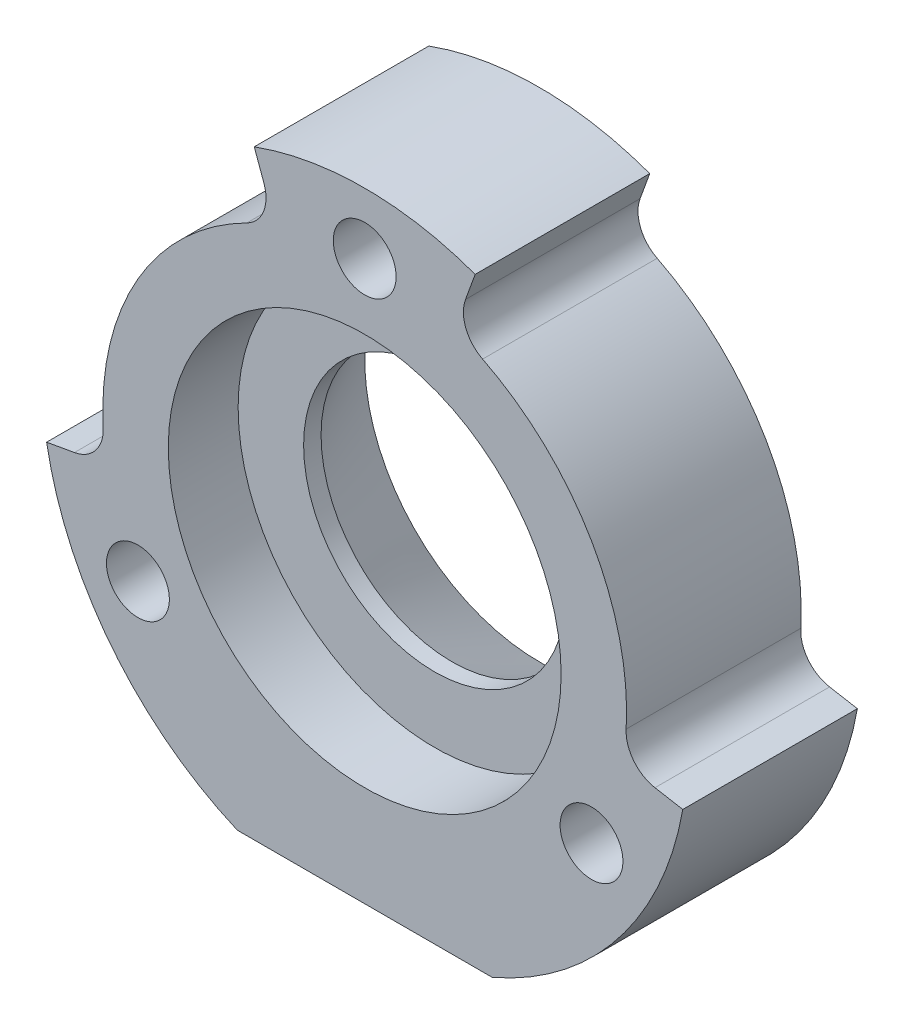
ISO-10303-21;
HEADER;
FILE_DESCRIPTION(('STEP AP214'),'2;1');
FILE_NAME('part.step','',(''),(''),'','','');
FILE_SCHEMA(('AUTOMOTIVE_DESIGN { 1 0 10303 214 1 1 1 1 }'));
ENDSEC;
DATA;
#1=APPLICATION_CONTEXT('core data for automotive mechanical design processes');
#2=APPLICATION_PROTOCOL_DEFINITION('international standard','automotive_design',2000,#1);
#3=PRODUCT_CONTEXT('',#1,'mechanical');
#4=PRODUCT('Part','Part','',(#3));
#5=PRODUCT_RELATED_PRODUCT_CATEGORY('part','',(#4));
#6=PRODUCT_DEFINITION_FORMATION('','',#4);
#7=PRODUCT_DEFINITION_CONTEXT('part definition',#1,'design');
#8=PRODUCT_DEFINITION('design','',#6,#7);
#9=PRODUCT_DEFINITION_SHAPE('','',#8);
#10=(LENGTH_UNIT() NAMED_UNIT(*) SI_UNIT(.MILLI.,.METRE.));
#11=(NAMED_UNIT(*) PLANE_ANGLE_UNIT() SI_UNIT($,.RADIAN.));
#12=(NAMED_UNIT(*) SI_UNIT($,.STERADIAN.) SOLID_ANGLE_UNIT());
#13=UNCERTAINTY_MEASURE_WITH_UNIT(LENGTH_MEASURE(1.E-05),#10,'distance_accuracy_value','');
#14=(GEOMETRIC_REPRESENTATION_CONTEXT(3) GLOBAL_UNCERTAINTY_ASSIGNED_CONTEXT((#13)) GLOBAL_UNIT_ASSIGNED_CONTEXT((#10,
#11,#12)) REPRESENTATION_CONTEXT('',''));
#15=CARTESIAN_POINT('',(0.,0.,0.));
#16=DIRECTION('',(0.,0.,1.));
#17=DIRECTION('',(1.,0.,0.));
#18=AXIS2_PLACEMENT_3D('',#15,#16,#17);
#19=CARTESIAN_POINT('',(-450.,150.,0.));
#20=DIRECTION('',(0.,0.,1.));
#21=DIRECTION('',(1.,0.,0.));
#22=AXIS2_PLACEMENT_3D('',#19,#20,#21);
#23=CYLINDRICAL_SURFACE('',#22,18.4999999999999);
#24=DIRECTION('',(0.,0.,-1.));
#25=VECTOR('',#24,1.);
#26=CARTESIAN_POINT('',(-468.218943430726,146.787508713162,10.));
#27=LINE('',#26,#25);
#28=CARTESIAN_POINT('',(-468.218943430726,146.787508713162,10.));
#29=VERTEX_POINT('',#28);
#30=CARTESIAN_POINT('',(-468.218943430726,146.787508713162,0.));
#31=VERTEX_POINT('',#30);
#32=EDGE_CURVE('E148',#29,#31,#27,.T.);
#33=ORIENTED_EDGE('',*,*,#32,.T.);
#34=CARTESIAN_POINT('',(-450.,150.,0.));
#35=DIRECTION('',(0.,0.,1.));
#36=DIRECTION('',(1.,0.,0.));
#37=AXIS2_PLACEMENT_3D('',#34,#35,#36);
#38=CIRCLE('',#37,18.4999999999999);
#39=CARTESIAN_POINT('',(-457.297259759663,133.,0.));
#40=VERTEX_POINT('',#39);
#41=EDGE_CURVE('E168',#31,#40,#38,.T.);
#42=ORIENTED_EDGE('',*,*,#41,.T.);
#43=DIRECTION('',(0.,0.,1.));
#44=VECTOR('',#43,1.);
#45=CARTESIAN_POINT('',(-457.297259759663,133.,0.));
#46=LINE('',#45,#44);
#47=CARTESIAN_POINT('',(-457.297259759663,133.,10.));
#48=VERTEX_POINT('',#47);
#49=EDGE_CURVE('E172',#40,#48,#46,.T.);
#50=ORIENTED_EDGE('',*,*,#49,.T.);
#51=CARTESIAN_POINT('',(-450.,150.,10.));
#52=DIRECTION('',(0.,0.,1.));
#53=DIRECTION('',(1.,0.,0.));
#54=AXIS2_PLACEMENT_3D('',#51,#52,#53);
#55=CIRCLE('',#54,18.4999999999999);
#56=EDGE_CURVE('E157',#29,#48,#55,.T.);
#57=ORIENTED_EDGE('',*,*,#56,.F.);
#58=EDGE_LOOP('',(#33,#42,#50,#57));
#59=FACE_BOUND('',#58,.T.);
#60=ADVANCED_FACE('F33',(#59),#23,.T.);
#61=DIRECTION('',(0.,0.,-1.));
#62=VECTOR('',#61,1.);
#63=CARTESIAN_POINT('',(-456.327372651525,167.384313484539,10.));
#64=LINE('',#63,#62);
#65=CARTESIAN_POINT('',(-456.327372651525,167.384313484539,10.));
#66=VERTEX_POINT('',#65);
#67=CARTESIAN_POINT('',(-456.327372651525,167.384313484539,0.));
#68=VERTEX_POINT('',#67);
#69=EDGE_CURVE('E133',#66,#68,#64,.T.);
#70=ORIENTED_EDGE('',*,*,#69,.F.);
#71=CARTESIAN_POINT('',(-443.672627348475,167.384313484539,10.));
#72=VERTEX_POINT('',#71);
#73=EDGE_CURVE('E145',#72,#66,#55,.T.);
#74=ORIENTED_EDGE('',*,*,#73,.F.);
#75=DIRECTION('',(0.,0.,-1.));
#76=VECTOR('',#75,1.);
#77=CARTESIAN_POINT('',(-443.672627348475,167.384313484539,10.));
#78=LINE('',#77,#76);
#79=CARTESIAN_POINT('',(-443.672627348475,167.384313484539,0.));
#80=VERTEX_POINT('',#79);
#81=EDGE_CURVE('E161',#72,#80,#78,.T.);
#82=ORIENTED_EDGE('',*,*,#81,.T.);
#83=EDGE_CURVE('E147',#80,#68,#38,.T.);
#84=ORIENTED_EDGE('',*,*,#83,.T.);
#85=EDGE_LOOP('',(#70,#74,#82,#84));
#86=FACE_BOUND('',#85,.T.);
#87=ADVANCED_FACE('F143',(#86),#23,.T.);
#88=DIRECTION('',(0.,0.,-1.));
#89=VECTOR('',#88,1.);
#90=CARTESIAN_POINT('',(-431.781056569274,146.787508713162,10.));
#91=LINE('',#90,#89);
#92=CARTESIAN_POINT('',(-431.781056569274,146.787508713162,10.));
#93=VERTEX_POINT('',#92);
#94=CARTESIAN_POINT('',(-431.781056569274,146.787508713162,0.));
#95=VERTEX_POINT('',#94);
#96=EDGE_CURVE('E241',#93,#95,#91,.T.);
#97=ORIENTED_EDGE('',*,*,#96,.F.);
#98=CARTESIAN_POINT('',(-442.702740240337,133.,10.));
#99=VERTEX_POINT('',#98);
#100=EDGE_CURVE('E156',#99,#93,#55,.T.);
#101=ORIENTED_EDGE('',*,*,#100,.F.);
#102=DIRECTION('',(0.,0.,1.));
#103=VECTOR('',#102,1.);
#104=CARTESIAN_POINT('',(-442.702740240337,133.,0.));
#105=LINE('',#104,#103);
#106=CARTESIAN_POINT('',(-442.702740240337,133.,0.));
#107=VERTEX_POINT('',#106);
#108=EDGE_CURVE('E169',#107,#99,#105,.T.);
#109=ORIENTED_EDGE('',*,*,#108,.F.);
#110=EDGE_CURVE('E249',#107,#95,#38,.T.);
#111=ORIENTED_EDGE('',*,*,#110,.T.);
#112=EDGE_LOOP('',(#97,#101,#109,#111));
#113=FACE_BOUND('',#112,.T.);
#114=ADVANCED_FACE('F365',(#113),#23,.T.);
#115=CARTESIAN_POINT('',(-457.297259759663,133.,0.));
#116=DIRECTION('',(0.,-1.,0.));
#117=DIRECTION('',(0.,0.,-1.));
#118=AXIS2_PLACEMENT_3D('',#115,#116,#117);
#119=PLANE('',#118);
#120=DIRECTION('',(1.,0.,0.));
#121=VECTOR('',#120,1.);
#122=CARTESIAN_POINT('',(-457.297259759663,133.,10.));
#123=LINE('',#122,#121);
#124=EDGE_CURVE('E160',#48,#99,#123,.T.);
#125=ORIENTED_EDGE('',*,*,#124,.F.);
#126=ORIENTED_EDGE('',*,*,#49,.F.);
#127=DIRECTION('',(1.,0.,0.));
#128=VECTOR('',#127,1.);
#129=CARTESIAN_POINT('',(-457.297259759663,133.,0.));
#130=LINE('',#129,#128);
#131=EDGE_CURVE('E164',#40,#107,#130,.T.);
#132=ORIENTED_EDGE('',*,*,#131,.T.);
#133=ORIENTED_EDGE('',*,*,#108,.T.);
#134=EDGE_LOOP('',(#125,#126,#132,#133));
#135=FACE_BOUND('',#134,.T.);
#136=ADVANCED_FACE('F260',(#135),#119,.T.);
#137=CARTESIAN_POINT('',(-450.,150.,0.));
#138=DIRECTION('',(0.,0.,1.));
#139=DIRECTION('',(1.,0.,0.));
#140=AXIS2_PLACEMENT_3D('',#137,#138,#139);
#141=PLANE('',#140);
#142=CARTESIAN_POINT('',(-450.,150.,0.));
#143=DIRECTION('',(0.,0.,1.));
#144=DIRECTION('',(1.,0.,0.));
#145=AXIS2_PLACEMENT_3D('',#142,#143,#144);
#146=CIRCLE('',#145,10.);
#147=CARTESIAN_POINT('',(-440.,150.,0.));
#148=VERTEX_POINT('',#147);
#149=EDGE_CURVE('E313',#148,#148,#146,.T.);
#150=ORIENTED_EDGE('',*,*,#149,.T.);
#151=EDGE_LOOP('',(#150));
#152=FACE_BOUND('',#151,.T.);
#153=CARTESIAN_POINT('',(-437.009618943233,142.5,0.));
#154=DIRECTION('',(0.,0.,-1.));
#155=DIRECTION('',(-1.,0.,0.));
#156=AXIS2_PLACEMENT_3D('',#153,#154,#155);
#157=CIRCLE('',#156,1.80000000000002);
#158=CARTESIAN_POINT('',(-438.809618943233,142.5,0.));
#159=VERTEX_POINT('',#158);
#160=EDGE_CURVE('E298',#159,#159,#157,.T.);
#161=ORIENTED_EDGE('',*,*,#160,.F.);
#162=EDGE_LOOP('',(#161));
#163=FACE_BOUND('',#162,.T.);
#164=CARTESIAN_POINT('',(-450.,165.,0.));
#165=DIRECTION('',(0.,0.,-1.));
#166=DIRECTION('',(-1.,0.,0.));
#167=AXIS2_PLACEMENT_3D('',#164,#165,#166);
#168=CIRCLE('',#167,1.80000000000002);
#169=CARTESIAN_POINT('',(-451.8,165.,0.));
#170=VERTEX_POINT('',#169);
#171=EDGE_CURVE('E292',#170,#170,#168,.T.);
#172=ORIENTED_EDGE('',*,*,#171,.F.);
#173=EDGE_LOOP('',(#172));
#174=FACE_BOUND('',#173,.T.);
#175=CARTESIAN_POINT('',(-462.990381056767,142.5,0.));
#176=DIRECTION('',(0.,0.,-1.));
#177=DIRECTION('',(-1.,0.,0.));
#178=AXIS2_PLACEMENT_3D('',#175,#176,#177);
#179=CIRCLE('',#178,1.80000000000002);
#180=CARTESIAN_POINT('',(-464.790381056767,142.5,0.));
#181=VERTEX_POINT('',#180);
#182=EDGE_CURVE('E286',#181,#181,#179,.T.);
#183=ORIENTED_EDGE('',*,*,#182,.F.);
#184=EDGE_LOOP('',(#183));
#185=FACE_BOUND('',#184,.T.);
#186=ORIENTED_EDGE('',*,*,#41,.F.);
#187=DIRECTION('',(-0.984807753012215,-0.173648177666892,0.));
#188=VECTOR('',#187,1.);
#189=CARTESIAN_POINT('',(-464.772116295183,147.395277334996,0.));
#190=LINE('',#189,#188);
#191=CARTESIAN_POINT('',(-466.625468368199,147.068481359772,0.));
#192=VERTEX_POINT('',#191);
#193=EDGE_CURVE('E138',#192,#31,#190,.T.);
#194=ORIENTED_EDGE('',*,*,#193,.F.);
#195=CARTESIAN_POINT('',(-466.972764723533,149.038096865796,0.));
#196=DIRECTION('',(0.,0.,1.));
#197=DIRECTION('',(1.,0.,0.));
#198=AXIS2_PLACEMENT_3D('',#195,#196,#197);
#199=CIRCLE('',#198,2.);
#200=CARTESIAN_POINT('',(-464.975968873706,149.151261940408,0.));
#201=VERTEX_POINT('',#200);
#202=EDGE_CURVE('E201',#192,#201,#199,.T.);
#203=ORIENTED_EDGE('',*,*,#202,.T.);
#204=CARTESIAN_POINT('',(-450.,150.,0.));
#205=DIRECTION('',(0.,0.,1.));
#206=DIRECTION('',(1.,0.,0.));
#207=AXIS2_PLACEMENT_3D('',#204,#205,#206);
#208=CIRCLE('',#207,15.);
#209=CARTESIAN_POINT('',(-456.752955716087,163.39393852071,0.));
#210=VERTEX_POINT('',#209);
#211=EDGE_CURVE('E221',#210,#201,#208,.T.);
#212=ORIENTED_EDGE('',*,*,#211,.F.);
#213=CARTESIAN_POINT('',(-457.653349811566,165.179796990138,0.));
#214=DIRECTION('',(0.,0.,1.));
#215=DIRECTION('',(1.,0.,0.));
#216=AXIS2_PLACEMENT_3D('',#213,#214,#215);
#217=CIRCLE('',#216,2.);
#218=CARTESIAN_POINT('',(-455.773964569994,165.86383727679,0.));
#219=VERTEX_POINT('',#218);
#220=EDGE_CURVE('E41',#210,#219,#217,.T.);
#221=ORIENTED_EDGE('',*,*,#220,.T.);
#222=DIRECTION('',(0.342020143325779,-0.939692620785868,0.));
#223=VECTOR('',#222,1.);
#224=CARTESIAN_POINT('',(-456.327372651525,167.384313484539,0.));
#225=LINE('',#224,#223);
#226=EDGE_CURVE('E225',#68,#219,#225,.T.);
#227=ORIENTED_EDGE('',*,*,#226,.F.);
#228=ORIENTED_EDGE('',*,*,#83,.F.);
#229=DIRECTION('',(0.342020143325652,0.939692620785915,0.));
#230=VECTOR('',#229,1.);
#231=CARTESIAN_POINT('',(-444.869697850115,164.095389311789,0.));
#232=LINE('',#231,#230);
#233=CARTESIAN_POINT('',(-444.226035430006,165.863837276789,0.));
#234=VERTEX_POINT('',#233);
#235=EDGE_CURVE('E237',#234,#80,#232,.T.);
#236=ORIENTED_EDGE('',*,*,#235,.F.);
#237=CARTESIAN_POINT('',(-442.346650188434,165.179796990138,0.));
#238=DIRECTION('',(0.,0.,1.));
#239=DIRECTION('',(1.,0.,0.));
#240=AXIS2_PLACEMENT_3D('',#237,#238,#239);
#241=CIRCLE('',#240,2.);
#242=CARTESIAN_POINT('',(-443.247044283912,163.39393852071,0.));
#243=VERTEX_POINT('',#242);
#244=EDGE_CURVE('E197',#234,#243,#241,.T.);
#245=ORIENTED_EDGE('',*,*,#244,.T.);
#246=CARTESIAN_POINT('',(-450.,150.,0.));
#247=DIRECTION('',(0.,0.,1.));
#248=DIRECTION('',(1.,0.,0.));
#249=AXIS2_PLACEMENT_3D('',#246,#247,#248);
#250=CIRCLE('',#249,15.);
#251=CARTESIAN_POINT('',(-435.024031126294,149.151261940408,0.));
#252=VERTEX_POINT('',#251);
#253=EDGE_CURVE('E244',#252,#243,#250,.T.);
#254=ORIENTED_EDGE('',*,*,#253,.F.);
#255=CARTESIAN_POINT('',(-433.027235276467,149.038096865796,0.));
#256=DIRECTION('',(0.,0.,1.));
#257=DIRECTION('',(1.,0.,0.));
#258=AXIS2_PLACEMENT_3D('',#255,#256,#257);
#259=CIRCLE('',#258,2.);
#260=CARTESIAN_POINT('',(-433.374531631801,147.068481359771,0.));
#261=VERTEX_POINT('',#260);
#262=EDGE_CURVE('E193',#252,#261,#259,.T.);
#263=ORIENTED_EDGE('',*,*,#262,.T.);
#264=DIRECTION('',(-0.984807753012205,0.173648177666946,0.));
#265=VECTOR('',#264,1.);
#266=CARTESIAN_POINT('',(-431.781056569274,146.787508713162,0.));
#267=LINE('',#266,#265);
#268=EDGE_CURVE('E231',#95,#261,#267,.T.);
#269=ORIENTED_EDGE('',*,*,#268,.F.);
#270=ORIENTED_EDGE('',*,*,#110,.F.);
#271=ORIENTED_EDGE('',*,*,#131,.F.);
#272=EDGE_LOOP('',(#186,#194,#203,#212,#221,#227,#228,#236,#245,#254,#263,#269,#270,#271));
#273=FACE_BOUND('',#272,.T.);
#274=ADVANCED_FACE('F220',(#152,#163,#174,#185,#273),#141,.F.);
#275=CARTESIAN_POINT('',(-450.,150.,10.));
#276=DIRECTION('',(0.,0.,1.));
#277=DIRECTION('',(1.,0.,0.));
#278=AXIS2_PLACEMENT_3D('',#275,#276,#277);
#279=PLANE('',#278);
#280=CARTESIAN_POINT('',(-450.,150.,10.));
#281=DIRECTION('',(0.,0.,1.));
#282=DIRECTION('',(1.,0.,0.));
#283=AXIS2_PLACEMENT_3D('',#280,#281,#282);
#284=CIRCLE('',#283,11.25);
#285=CARTESIAN_POINT('',(-438.75,150.,10.));
#286=VERTEX_POINT('',#285);
#287=EDGE_CURVE('E310',#286,#286,#284,.T.);
#288=ORIENTED_EDGE('',*,*,#287,.F.);
#289=EDGE_LOOP('',(#288));
#290=FACE_BOUND('',#289,.T.);
#291=CARTESIAN_POINT('',(-437.009618943233,142.5,9.99999999999999));
#292=DIRECTION('',(0.,0.,-1.));
#293=DIRECTION('',(-1.,0.,0.));
#294=AXIS2_PLACEMENT_3D('',#291,#292,#293);
#295=CIRCLE('',#294,1.80000000000002);
#296=CARTESIAN_POINT('',(-438.809618943233,142.5,9.99999999999999));
#297=VERTEX_POINT('',#296);
#298=EDGE_CURVE('E295',#297,#297,#295,.T.);
#299=ORIENTED_EDGE('',*,*,#298,.T.);
#300=EDGE_LOOP('',(#299));
#301=FACE_BOUND('',#300,.T.);
#302=CARTESIAN_POINT('',(-450.,165.,9.99999999999999));
#303=DIRECTION('',(0.,0.,-1.));
#304=DIRECTION('',(-1.,0.,0.));
#305=AXIS2_PLACEMENT_3D('',#302,#303,#304);
#306=CIRCLE('',#305,1.80000000000002);
#307=CARTESIAN_POINT('',(-451.8,165.,9.99999999999999));
#308=VERTEX_POINT('',#307);
#309=EDGE_CURVE('E289',#308,#308,#306,.T.);
#310=ORIENTED_EDGE('',*,*,#309,.T.);
#311=EDGE_LOOP('',(#310));
#312=FACE_BOUND('',#311,.T.);
#313=CARTESIAN_POINT('',(-462.990381056767,142.5,9.99999999999999));
#314=DIRECTION('',(0.,0.,-1.));
#315=DIRECTION('',(-1.,0.,0.));
#316=AXIS2_PLACEMENT_3D('',#313,#314,#315);
#317=CIRCLE('',#316,1.80000000000002);
#318=CARTESIAN_POINT('',(-464.790381056767,142.5,9.99999999999999));
#319=VERTEX_POINT('',#318);
#320=EDGE_CURVE('E228',#319,#319,#317,.T.);
#321=ORIENTED_EDGE('',*,*,#320,.T.);
#322=EDGE_LOOP('',(#321));
#323=FACE_BOUND('',#322,.T.);
#324=CARTESIAN_POINT('',(-450.,150.,10.));
#325=DIRECTION('',(0.,0.,1.));
#326=DIRECTION('',(1.,0.,0.));
#327=AXIS2_PLACEMENT_3D('',#324,#325,#326);
#328=CIRCLE('',#327,15.);
#329=CARTESIAN_POINT('',(-456.752955716087,163.39393852071,10.));
#330=VERTEX_POINT('',#329);
#331=CARTESIAN_POINT('',(-464.975968873706,149.151261940408,10.));
#332=VERTEX_POINT('',#331);
#333=EDGE_CURVE('E137',#330,#332,#328,.T.);
#334=ORIENTED_EDGE('',*,*,#333,.T.);
#335=CARTESIAN_POINT('',(-466.972764723533,149.038096865796,10.));
#336=DIRECTION('',(0.,0.,1.));
#337=DIRECTION('',(1.,0.,0.));
#338=AXIS2_PLACEMENT_3D('',#335,#336,#337);
#339=CIRCLE('',#338,2.);
#340=CARTESIAN_POINT('',(-466.625468368199,147.068481359772,10.));
#341=VERTEX_POINT('',#340);
#342=EDGE_CURVE('E203',#332,#341,#339,.F.);
#343=ORIENTED_EDGE('',*,*,#342,.T.);
#344=DIRECTION('',(-0.984807753012215,-0.173648177666892,0.));
#345=VECTOR('',#344,1.);
#346=CARTESIAN_POINT('',(-464.772116295183,147.395277334996,10.));
#347=LINE('',#346,#345);
#348=EDGE_CURVE('E149',#341,#29,#347,.T.);
#349=ORIENTED_EDGE('',*,*,#348,.T.);
#350=ORIENTED_EDGE('',*,*,#56,.T.);
#351=ORIENTED_EDGE('',*,*,#124,.T.);
#352=ORIENTED_EDGE('',*,*,#100,.T.);
#353=DIRECTION('',(-0.984807753012205,0.173648177666946,0.));
#354=VECTOR('',#353,1.);
#355=CARTESIAN_POINT('',(-431.781056569274,146.787508713162,10.));
#356=LINE('',#355,#354);
#357=CARTESIAN_POINT('',(-433.374531631801,147.068481359771,10.));
#358=VERTEX_POINT('',#357);
#359=EDGE_CURVE('E233',#93,#358,#356,.T.);
#360=ORIENTED_EDGE('',*,*,#359,.T.);
#361=CARTESIAN_POINT('',(-433.027235276467,149.038096865796,10.));
#362=DIRECTION('',(0.,0.,1.));
#363=DIRECTION('',(1.,0.,0.));
#364=AXIS2_PLACEMENT_3D('',#361,#362,#363);
#365=CIRCLE('',#364,2.);
#366=CARTESIAN_POINT('',(-435.024031126294,149.151261940408,10.));
#367=VERTEX_POINT('',#366);
#368=EDGE_CURVE('E195',#358,#367,#365,.F.);
#369=ORIENTED_EDGE('',*,*,#368,.T.);
#370=CARTESIAN_POINT('',(-450.,150.,10.));
#371=DIRECTION('',(0.,0.,1.));
#372=DIRECTION('',(1.,0.,0.));
#373=AXIS2_PLACEMENT_3D('',#370,#371,#372);
#374=CIRCLE('',#373,15.);
#375=CARTESIAN_POINT('',(-443.247044283912,163.39393852071,10.));
#376=VERTEX_POINT('',#375);
#377=EDGE_CURVE('E236',#367,#376,#374,.T.);
#378=ORIENTED_EDGE('',*,*,#377,.T.);
#379=CARTESIAN_POINT('',(-442.346650188434,165.179796990138,10.));
#380=DIRECTION('',(0.,0.,1.));
#381=DIRECTION('',(1.,0.,0.));
#382=AXIS2_PLACEMENT_3D('',#379,#380,#381);
#383=CIRCLE('',#382,2.);
#384=CARTESIAN_POINT('',(-444.226035430006,165.863837276789,10.));
#385=VERTEX_POINT('',#384);
#386=EDGE_CURVE('E199',#376,#385,#383,.F.);
#387=ORIENTED_EDGE('',*,*,#386,.T.);
#388=DIRECTION('',(0.342020143325652,0.939692620785915,0.));
#389=VECTOR('',#388,1.);
#390=CARTESIAN_POINT('',(-444.869697850115,164.095389311789,10.));
#391=LINE('',#390,#389);
#392=EDGE_CURVE('E154',#385,#72,#391,.T.);
#393=ORIENTED_EDGE('',*,*,#392,.T.);
#394=ORIENTED_EDGE('',*,*,#73,.T.);
#395=DIRECTION('',(0.342020143325779,-0.939692620785868,0.));
#396=VECTOR('',#395,1.);
#397=CARTESIAN_POINT('',(-456.327372651525,167.384313484539,10.));
#398=LINE('',#397,#396);
#399=CARTESIAN_POINT('',(-455.773964569994,165.86383727679,10.));
#400=VERTEX_POINT('',#399);
#401=EDGE_CURVE('E130',#66,#400,#398,.T.);
#402=ORIENTED_EDGE('',*,*,#401,.T.);
#403=CARTESIAN_POINT('',(-457.653349811566,165.179796990138,10.));
#404=DIRECTION('',(0.,0.,1.));
#405=DIRECTION('',(1.,0.,0.));
#406=AXIS2_PLACEMENT_3D('',#403,#404,#405);
#407=CIRCLE('',#406,2.);
#408=EDGE_CURVE('E11',#400,#330,#407,.F.);
#409=ORIENTED_EDGE('',*,*,#408,.T.);
#410=EDGE_LOOP('',(#334,#343,#349,#350,#351,#352,#360,#369,#378,#387,#393,#394,#402,#409));
#411=FACE_BOUND('',#410,.T.);
#412=ADVANCED_FACE('F152',(#290,#301,#312,#323,#411),#279,.T.);
#413=CARTESIAN_POINT('',(-444.869697850115,164.095389311789,10.));
#414=DIRECTION('',(-0.939692620785914,0.342020143325652,0.));
#415=DIRECTION('',(-0.342020143325652,-0.939692620785914,0.));
#416=AXIS2_PLACEMENT_3D('',#413,#414,#415);
#417=PLANE('',#416);
#418=ORIENTED_EDGE('',*,*,#392,.F.);
#419=DIRECTION('',(0.,0.,1.));
#420=VECTOR('',#419,1.);
#421=CARTESIAN_POINT('',(-444.226035430006,165.863837276789,0.));
#422=LINE('',#421,#420);
#423=EDGE_CURVE('E181',#385,#234,#422,.F.);
#424=ORIENTED_EDGE('',*,*,#423,.T.);
#425=ORIENTED_EDGE('',*,*,#235,.T.);
#426=ORIENTED_EDGE('',*,*,#81,.F.);
#427=EDGE_LOOP('',(#418,#424,#425,#426));
#428=FACE_BOUND('',#427,.T.);
#429=ADVANCED_FACE('F279',(#428),#417,.F.);
#430=CARTESIAN_POINT('',(-450.,150.,10.));
#431=DIRECTION('',(0.,0.,-1.));
#432=DIRECTION('',(-1.,0.,0.));
#433=AXIS2_PLACEMENT_3D('',#430,#431,#432);
#434=CYLINDRICAL_SURFACE('',#433,15.);
#435=ORIENTED_EDGE('',*,*,#377,.F.);
#436=DIRECTION('',(0.,0.,-1.));
#437=VECTOR('',#436,1.);
#438=CARTESIAN_POINT('',(-435.024031126294,149.151261940408,10.));
#439=LINE('',#438,#437);
#440=EDGE_CURVE('E176',#367,#252,#439,.T.);
#441=ORIENTED_EDGE('',*,*,#440,.T.);
#442=ORIENTED_EDGE('',*,*,#253,.T.);
#443=DIRECTION('',(0.,0.,-1.));
#444=VECTOR('',#443,1.);
#445=CARTESIAN_POINT('',(-443.247044283912,163.39393852071,10.));
#446=LINE('',#445,#444);
#447=EDGE_CURVE('E171',#243,#376,#446,.F.);
#448=ORIENTED_EDGE('',*,*,#447,.T.);
#449=EDGE_LOOP('',(#435,#441,#442,#448));
#450=FACE_BOUND('',#449,.T.);
#451=ADVANCED_FACE('F273',(#450),#434,.T.);
#452=CARTESIAN_POINT('',(-431.781056569274,146.787508713162,10.));
#453=DIRECTION('',(-0.173648177666946,-0.984807753012205,0.));
#454=DIRECTION('',(0.984807753012205,-0.173648177666946,0.));
#455=AXIS2_PLACEMENT_3D('',#452,#453,#454);
#456=PLANE('',#455);
#457=ORIENTED_EDGE('',*,*,#268,.T.);
#458=DIRECTION('',(0.,0.,1.));
#459=VECTOR('',#458,1.);
#460=CARTESIAN_POINT('',(-433.374531631801,147.068481359771,10.));
#461=LINE('',#460,#459);
#462=EDGE_CURVE('E179',#261,#358,#461,.T.);
#463=ORIENTED_EDGE('',*,*,#462,.T.);
#464=ORIENTED_EDGE('',*,*,#359,.F.);
#465=ORIENTED_EDGE('',*,*,#96,.T.);
#466=EDGE_LOOP('',(#457,#463,#464,#465));
#467=FACE_BOUND('',#466,.T.);
#468=ADVANCED_FACE('F265',(#467),#456,.F.);
#469=CARTESIAN_POINT('',(-464.772116295183,147.395277334996,10.));
#470=DIRECTION('',(0.173648177666892,-0.984807753012215,0.));
#471=DIRECTION('',(0.984807753012215,0.173648177666892,0.));
#472=AXIS2_PLACEMENT_3D('',#469,#470,#471);
#473=PLANE('',#472);
#474=ORIENTED_EDGE('',*,*,#348,.F.);
#475=DIRECTION('',(0.,0.,1.));
#476=VECTOR('',#475,1.);
#477=CARTESIAN_POINT('',(-466.625468368199,147.068481359772,0.));
#478=LINE('',#477,#476);
#479=EDGE_CURVE('E184',#341,#192,#478,.F.);
#480=ORIENTED_EDGE('',*,*,#479,.T.);
#481=ORIENTED_EDGE('',*,*,#193,.T.);
#482=ORIENTED_EDGE('',*,*,#32,.F.);
#483=EDGE_LOOP('',(#474,#480,#481,#482));
#484=FACE_BOUND('',#483,.T.);
#485=ADVANCED_FACE('F212',(#484),#473,.F.);
#486=CARTESIAN_POINT('',(-450.,150.,10.));
#487=DIRECTION('',(0.,0.,-1.));
#488=DIRECTION('',(-1.,0.,0.));
#489=AXIS2_PLACEMENT_3D('',#486,#487,#488);
#490=CYLINDRICAL_SURFACE('',#489,15.);
#491=ORIENTED_EDGE('',*,*,#211,.T.);
#492=DIRECTION('',(0.,0.,-1.));
#493=VECTOR('',#492,1.);
#494=CARTESIAN_POINT('',(-464.975968873706,149.151261940408,10.));
#495=LINE('',#494,#493);
#496=EDGE_CURVE('E190',#201,#332,#495,.F.);
#497=ORIENTED_EDGE('',*,*,#496,.T.);
#498=ORIENTED_EDGE('',*,*,#333,.F.);
#499=DIRECTION('',(0.,0.,-1.));
#500=VECTOR('',#499,1.);
#501=CARTESIAN_POINT('',(-456.752955716087,163.39393852071,10.));
#502=LINE('',#501,#500);
#503=EDGE_CURVE('E187',#330,#210,#502,.T.);
#504=ORIENTED_EDGE('',*,*,#503,.T.);
#505=EDGE_LOOP('',(#491,#497,#498,#504));
#506=FACE_BOUND('',#505,.T.);
#507=ADVANCED_FACE('F223',(#506),#490,.T.);
#508=CARTESIAN_POINT('',(-456.327372651525,167.384313484539,10.));
#509=DIRECTION('',(0.939692620785868,0.342020143325779,0.));
#510=DIRECTION('',(-0.342020143325779,0.939692620785868,0.));
#511=AXIS2_PLACEMENT_3D('',#508,#509,#510);
#512=PLANE('',#511);
#513=ORIENTED_EDGE('',*,*,#226,.T.);
#514=DIRECTION('',(0.,0.,1.));
#515=VECTOR('',#514,1.);
#516=CARTESIAN_POINT('',(-455.773964569994,165.86383727679,10.));
#517=LINE('',#516,#515);
#518=EDGE_CURVE('E48',#219,#400,#517,.T.);
#519=ORIENTED_EDGE('',*,*,#518,.T.);
#520=ORIENTED_EDGE('',*,*,#401,.F.);
#521=ORIENTED_EDGE('',*,*,#69,.T.);
#522=EDGE_LOOP('',(#513,#519,#520,#521));
#523=FACE_BOUND('',#522,.T.);
#524=ADVANCED_FACE('F132',(#523),#512,.F.);
#525=CARTESIAN_POINT('',(-462.990381056767,142.5,0.));
#526=DIRECTION('',(0.,0.,-1.));
#527=DIRECTION('',(-1.,0.,0.));
#528=AXIS2_PLACEMENT_3D('',#525,#526,#527);
#529=CYLINDRICAL_SURFACE('',#528,1.80000000000002);
#530=ORIENTED_EDGE('',*,*,#320,.F.);
#531=EDGE_LOOP('',(#530));
#532=FACE_BOUND('',#531,.T.);
#533=ORIENTED_EDGE('',*,*,#182,.T.);
#534=EDGE_LOOP('',(#533));
#535=FACE_BOUND('',#534,.T.);
#536=ADVANCED_FACE('F353',(#532,#535),#529,.F.);
#537=CARTESIAN_POINT('',(-450.,165.,0.));
#538=DIRECTION('',(0.,0.,-1.));
#539=DIRECTION('',(-1.,0.,0.));
#540=AXIS2_PLACEMENT_3D('',#537,#538,#539);
#541=CYLINDRICAL_SURFACE('',#540,1.80000000000002);
#542=ORIENTED_EDGE('',*,*,#309,.F.);
#543=EDGE_LOOP('',(#542));
#544=FACE_BOUND('',#543,.T.);
#545=ORIENTED_EDGE('',*,*,#171,.T.);
#546=EDGE_LOOP('',(#545));
#547=FACE_BOUND('',#546,.T.);
#548=ADVANCED_FACE('F356',(#544,#547),#541,.F.);
#549=CARTESIAN_POINT('',(-437.009618943233,142.5,0.));
#550=DIRECTION('',(0.,0.,-1.));
#551=DIRECTION('',(-1.,0.,0.));
#552=AXIS2_PLACEMENT_3D('',#549,#550,#551);
#553=CYLINDRICAL_SURFACE('',#552,1.80000000000002);
#554=ORIENTED_EDGE('',*,*,#298,.F.);
#555=EDGE_LOOP('',(#554));
#556=FACE_BOUND('',#555,.T.);
#557=ORIENTED_EDGE('',*,*,#160,.T.);
#558=EDGE_LOOP('',(#557));
#559=FACE_BOUND('',#558,.T.);
#560=ADVANCED_FACE('F323',(#556,#559),#553,.F.);
#561=CARTESIAN_POINT('',(-450.,150.,4.99999999999997));
#562=DIRECTION('',(0.,0.,-1.));
#563=DIRECTION('',(-1.,0.,0.));
#564=AXIS2_PLACEMENT_3D('',#561,#562,#563);
#565=CONICAL_SURFACE('',#564,7.50000000000001,0.463647609000809);
#566=ORIENTED_EDGE('',*,*,#149,.F.);
#567=EDGE_LOOP('',(#566));
#568=FACE_BOUND('',#567,.T.);
#569=CARTESIAN_POINT('',(-450.,150.,4.99999999999997));
#570=DIRECTION('',(0.,0.,1.));
#571=DIRECTION('',(1.,0.,0.));
#572=AXIS2_PLACEMENT_3D('',#569,#570,#571);
#573=CIRCLE('',#572,7.50000000000001);
#574=CARTESIAN_POINT('',(-442.5,150.,4.99999999999997));
#575=VERTEX_POINT('',#574);
#576=EDGE_CURVE('E301',#575,#575,#573,.T.);
#577=ORIENTED_EDGE('',*,*,#576,.T.);
#578=EDGE_LOOP('',(#577));
#579=FACE_BOUND('',#578,.T.);
#580=ADVANCED_FACE('F319',(#568,#579),#565,.F.);
#581=CARTESIAN_POINT('',(-450.,150.,10.));
#582=DIRECTION('',(0.,0.,1.));
#583=DIRECTION('',(1.,0.,0.));
#584=AXIS2_PLACEMENT_3D('',#581,#582,#583);
#585=CYLINDRICAL_SURFACE('',#584,7.50000000000001);
#586=ORIENTED_EDGE('',*,*,#576,.F.);
#587=EDGE_LOOP('',(#586));
#588=FACE_BOUND('',#587,.T.);
#589=CARTESIAN_POINT('',(-450.,150.,6.));
#590=DIRECTION('',(0.,0.,1.));
#591=DIRECTION('',(1.,0.,0.));
#592=AXIS2_PLACEMENT_3D('',#589,#590,#591);
#593=CIRCLE('',#592,7.50000000000001);
#594=CARTESIAN_POINT('',(-442.5,150.,6.));
#595=VERTEX_POINT('',#594);
#596=EDGE_CURVE('E304',#595,#595,#593,.T.);
#597=ORIENTED_EDGE('',*,*,#596,.T.);
#598=EDGE_LOOP('',(#597));
#599=FACE_BOUND('',#598,.T.);
#600=ADVANCED_FACE('F322',(#588,#599),#585,.F.);
#601=CARTESIAN_POINT('',(-442.5,150.,6.));
#602=DIRECTION('',(0.,0.,-1.));
#603=DIRECTION('',(-1.,0.,0.));
#604=AXIS2_PLACEMENT_3D('',#601,#602,#603);
#605=PLANE('',#604);
#606=ORIENTED_EDGE('',*,*,#596,.F.);
#607=EDGE_LOOP('',(#606));
#608=FACE_BOUND('',#607,.T.);
#609=CARTESIAN_POINT('',(-450.,150.,6.));
#610=DIRECTION('',(0.,0.,1.));
#611=DIRECTION('',(1.,0.,0.));
#612=AXIS2_PLACEMENT_3D('',#609,#610,#611);
#613=CIRCLE('',#612,11.25);
#614=CARTESIAN_POINT('',(-438.75,150.,6.));
#615=VERTEX_POINT('',#614);
#616=EDGE_CURVE('E307',#615,#615,#613,.T.);
#617=ORIENTED_EDGE('',*,*,#616,.T.);
#618=EDGE_LOOP('',(#617));
#619=FACE_BOUND('',#618,.T.);
#620=ADVANCED_FACE('F329',(#608,#619),#605,.F.);
#621=CARTESIAN_POINT('',(-450.,150.,10.));
#622=DIRECTION('',(0.,0.,1.));
#623=DIRECTION('',(1.,0.,0.));
#624=AXIS2_PLACEMENT_3D('',#621,#622,#623);
#625=CYLINDRICAL_SURFACE('',#624,11.25);
#626=ORIENTED_EDGE('',*,*,#616,.F.);
#627=EDGE_LOOP('',(#626));
#628=FACE_BOUND('',#627,.T.);
#629=ORIENTED_EDGE('',*,*,#287,.T.);
#630=EDGE_LOOP('',(#629));
#631=FACE_BOUND('',#630,.T.);
#632=ADVANCED_FACE('F335',(#628,#631),#625,.F.);
#633=CARTESIAN_POINT('',(-433.027235276467,149.038096865796,10.));
#634=DIRECTION('',(0.,0.,-1.));
#635=DIRECTION('',(-1.,0.,0.));
#636=AXIS2_PLACEMENT_3D('',#633,#634,#635);
#637=CYLINDRICAL_SURFACE('',#636,2.);
#638=ORIENTED_EDGE('',*,*,#368,.F.);
#639=ORIENTED_EDGE('',*,*,#462,.F.);
#640=ORIENTED_EDGE('',*,*,#262,.F.);
#641=ORIENTED_EDGE('',*,*,#440,.F.);
#642=EDGE_LOOP('',(#638,#639,#640,#641));
#643=FACE_BOUND('',#642,.T.);
#644=ADVANCED_FACE('F268',(#643),#637,.F.);
#645=CARTESIAN_POINT('',(-442.346650188434,165.179796990138,10.));
#646=DIRECTION('',(0.,0.,-1.));
#647=DIRECTION('',(-1.,0.,0.));
#648=AXIS2_PLACEMENT_3D('',#645,#646,#647);
#649=CYLINDRICAL_SURFACE('',#648,2.);
#650=ORIENTED_EDGE('',*,*,#386,.F.);
#651=ORIENTED_EDGE('',*,*,#447,.F.);
#652=ORIENTED_EDGE('',*,*,#244,.F.);
#653=ORIENTED_EDGE('',*,*,#423,.F.);
#654=EDGE_LOOP('',(#650,#651,#652,#653));
#655=FACE_BOUND('',#654,.T.);
#656=ADVANCED_FACE('F276',(#655),#649,.F.);
#657=CARTESIAN_POINT('',(-466.972764723533,149.038096865796,10.));
#658=DIRECTION('',(0.,0.,-1.));
#659=DIRECTION('',(-1.,0.,0.));
#660=AXIS2_PLACEMENT_3D('',#657,#658,#659);
#661=CYLINDRICAL_SURFACE('',#660,2.);
#662=ORIENTED_EDGE('',*,*,#342,.F.);
#663=ORIENTED_EDGE('',*,*,#496,.F.);
#664=ORIENTED_EDGE('',*,*,#202,.F.);
#665=ORIENTED_EDGE('',*,*,#479,.F.);
#666=EDGE_LOOP('',(#662,#663,#664,#665));
#667=FACE_BOUND('',#666,.T.);
#668=ADVANCED_FACE('F217',(#667),#661,.F.);
#669=CARTESIAN_POINT('',(-457.653349811566,165.179796990138,10.));
#670=DIRECTION('',(0.,0.,-1.));
#671=DIRECTION('',(-1.,0.,0.));
#672=AXIS2_PLACEMENT_3D('',#669,#670,#671);
#673=CYLINDRICAL_SURFACE('',#672,2.);
#674=ORIENTED_EDGE('',*,*,#408,.F.);
#675=ORIENTED_EDGE('',*,*,#518,.F.);
#676=ORIENTED_EDGE('',*,*,#220,.F.);
#677=ORIENTED_EDGE('',*,*,#503,.F.);
#678=EDGE_LOOP('',(#674,#675,#676,#677));
#679=FACE_BOUND('',#678,.T.);
#680=ADVANCED_FACE('F35',(#679),#673,.F.);
#681=CLOSED_SHELL('',(#60,#87,#114,#136,#274,#412,#429,#451,#468,#485,#507,#524,#536,#548,#560,
#580,#600,#620,#632,#644,#656,#668,#680));
#682=MANIFOLD_SOLID_BREP('B2',#681);
#683=ADVANCED_BREP_SHAPE_REPRESENTATION('',(#18,#682),#14);
#684=SHAPE_DEFINITION_REPRESENTATION(#9,#683);
ENDSEC;
END-ISO-10303-21;
